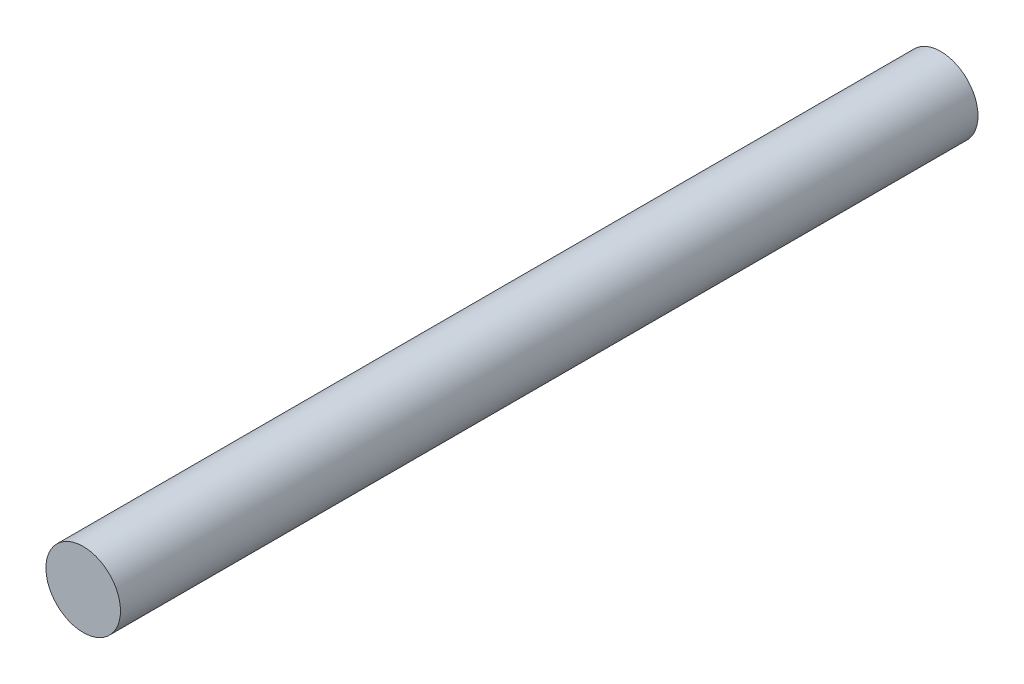
ISO-10303-21;
HEADER;
FILE_DESCRIPTION(('STEP AP214'),'2;1');
FILE_NAME('part.step','',(''),(''),'','','');
FILE_SCHEMA(('AUTOMOTIVE_DESIGN { 1 0 10303 214 1 1 1 1 }'));
ENDSEC;
DATA;
#1=APPLICATION_CONTEXT('core data for automotive mechanical design processes');
#2=APPLICATION_PROTOCOL_DEFINITION('international standard','automotive_design',2000,#1);
#3=PRODUCT_CONTEXT('',#1,'mechanical');
#4=PRODUCT('Part','Part','',(#3));
#5=PRODUCT_RELATED_PRODUCT_CATEGORY('part','',(#4));
#6=PRODUCT_DEFINITION_FORMATION('','',#4);
#7=PRODUCT_DEFINITION_CONTEXT('part definition',#1,'design');
#8=PRODUCT_DEFINITION('design','',#6,#7);
#9=PRODUCT_DEFINITION_SHAPE('','',#8);
#10=(LENGTH_UNIT() NAMED_UNIT(*) SI_UNIT(.MILLI.,.METRE.));
#11=(NAMED_UNIT(*) PLANE_ANGLE_UNIT() SI_UNIT($,.RADIAN.));
#12=(NAMED_UNIT(*) SI_UNIT($,.STERADIAN.) SOLID_ANGLE_UNIT());
#13=UNCERTAINTY_MEASURE_WITH_UNIT(LENGTH_MEASURE(1.E-05),#10,'distance_accuracy_value','');
#14=(GEOMETRIC_REPRESENTATION_CONTEXT(3) GLOBAL_UNCERTAINTY_ASSIGNED_CONTEXT((#13)) GLOBAL_UNIT_ASSIGNED_CONTEXT((#10,
#11,#12)) REPRESENTATION_CONTEXT('',''));
#15=CARTESIAN_POINT('',(0.,0.,0.));
#16=DIRECTION('',(0.,0.,1.));
#17=DIRECTION('',(1.,0.,0.));
#18=AXIS2_PLACEMENT_3D('',#15,#16,#17);
#19=CARTESIAN_POINT('',(0.,0.,92.));
#20=DIRECTION('',(0.,0.,-1.));
#21=DIRECTION('',(-1.,0.,0.));
#22=AXIS2_PLACEMENT_3D('',#19,#20,#21);
#23=CYLINDRICAL_SURFACE('',#22,4.);
#24=CARTESIAN_POINT('',(0.,0.,92.));
#25=DIRECTION('',(0.,0.,1.));
#26=DIRECTION('',(1.,0.,0.));
#27=AXIS2_PLACEMENT_3D('',#24,#25,#26);
#28=CIRCLE('',#27,4.);
#29=CARTESIAN_POINT('',(4.,0.,92.));
#30=VERTEX_POINT('',#29);
#31=EDGE_CURVE('E10',#30,#30,#28,.T.);
#32=ORIENTED_EDGE('',*,*,#31,.F.);
#33=EDGE_LOOP('',(#32));
#34=FACE_BOUND('',#33,.T.);
#35=CARTESIAN_POINT('',(0.,0.,0.));
#36=DIRECTION('',(0.,0.,1.));
#37=DIRECTION('',(1.,0.,0.));
#38=AXIS2_PLACEMENT_3D('',#35,#36,#37);
#39=CIRCLE('',#38,4.);
#40=CARTESIAN_POINT('',(4.,0.,0.));
#41=VERTEX_POINT('',#40);
#42=EDGE_CURVE('E34',#41,#41,#39,.T.);
#43=ORIENTED_EDGE('',*,*,#42,.T.);
#44=EDGE_LOOP('',(#43));
#45=FACE_BOUND('',#44,.T.);
#46=ADVANCED_FACE('F31',(#34,#45),#23,.T.);
#47=CARTESIAN_POINT('',(0.,0.,92.));
#48=DIRECTION('',(0.,0.,1.));
#49=DIRECTION('',(1.,0.,0.));
#50=AXIS2_PLACEMENT_3D('',#47,#48,#49);
#51=PLANE('',#50);
#52=ORIENTED_EDGE('',*,*,#31,.T.);
#53=EDGE_LOOP('',(#52));
#54=FACE_BOUND('',#53,.T.);
#55=ADVANCED_FACE('F46',(#54),#51,.T.);
#56=CARTESIAN_POINT('',(0.,0.,0.));
#57=DIRECTION('',(0.,0.,1.));
#58=DIRECTION('',(1.,0.,0.));
#59=AXIS2_PLACEMENT_3D('',#56,#57,#58);
#60=PLANE('',#59);
#61=ORIENTED_EDGE('',*,*,#42,.F.);
#62=EDGE_LOOP('',(#61));
#63=FACE_BOUND('',#62,.T.);
#64=ADVANCED_FACE('F44',(#63),#60,.F.);
#65=CLOSED_SHELL('',(#46,#55,#64));
#66=MANIFOLD_SOLID_BREP('B2',#65);
#67=ADVANCED_BREP_SHAPE_REPRESENTATION('',(#18,#66),#14);
#68=SHAPE_DEFINITION_REPRESENTATION(#9,#67);
ENDSEC;
END-ISO-10303-21;
